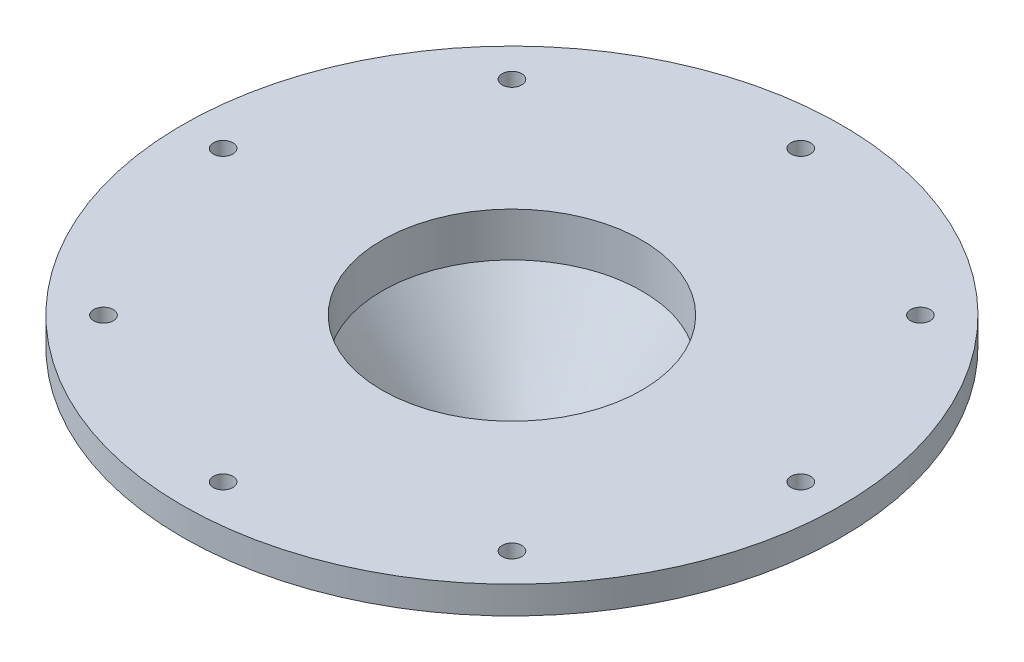
ISO-10303-21;
HEADER;
FILE_DESCRIPTION(('STEP AP214'),'2;1');
FILE_NAME('part.step','',(''),(''),'','','');
FILE_SCHEMA(('AUTOMOTIVE_DESIGN { 1 0 10303 214 1 1 1 1 }'));
ENDSEC;
DATA;
#1=APPLICATION_CONTEXT('core data for automotive mechanical design processes');
#2=APPLICATION_PROTOCOL_DEFINITION('international standard','automotive_design',2000,#1);
#3=PRODUCT_CONTEXT('',#1,'mechanical');
#4=PRODUCT('Part','Part','',(#3));
#5=PRODUCT_RELATED_PRODUCT_CATEGORY('part','',(#4));
#6=PRODUCT_DEFINITION_FORMATION('','',#4);
#7=PRODUCT_DEFINITION_CONTEXT('part definition',#1,'design');
#8=PRODUCT_DEFINITION('design','',#6,#7);
#9=PRODUCT_DEFINITION_SHAPE('','',#8);
#10=(LENGTH_UNIT() NAMED_UNIT(*) SI_UNIT(.MILLI.,.METRE.));
#11=(NAMED_UNIT(*) PLANE_ANGLE_UNIT() SI_UNIT($,.RADIAN.));
#12=(NAMED_UNIT(*) SI_UNIT($,.STERADIAN.) SOLID_ANGLE_UNIT());
#13=UNCERTAINTY_MEASURE_WITH_UNIT(LENGTH_MEASURE(1.E-05),#10,'distance_accuracy_value','');
#14=(GEOMETRIC_REPRESENTATION_CONTEXT(3) GLOBAL_UNCERTAINTY_ASSIGNED_CONTEXT((#13)) GLOBAL_UNIT_ASSIGNED_CONTEXT((#10,
#11,#12)) REPRESENTATION_CONTEXT('',''));
#15=CARTESIAN_POINT('',(0.,0.,0.));
#16=DIRECTION('',(0.,0.,1.));
#17=DIRECTION('',(1.,0.,0.));
#18=AXIS2_PLACEMENT_3D('',#15,#16,#17);
#19=CARTESIAN_POINT('',(0.,-19.05,0.));
#20=DIRECTION('',(0.,-1.,0.));
#21=DIRECTION('',(0.,0.,-1.));
#22=AXIS2_PLACEMENT_3D('',#19,#20,#21);
#23=PLANE('',#22);
#24=CARTESIAN_POINT('',(0.,-19.05,0.));
#25=DIRECTION('',(0.,-1.,0.));
#26=DIRECTION('',(0.,0.,-1.));
#27=AXIS2_PLACEMENT_3D('',#24,#25,#26);
#28=CIRCLE('',#27,5.);
#29=CARTESIAN_POINT('',(0.,-19.05,-5.));
#30=VERTEX_POINT('',#29);
#31=EDGE_CURVE('E54',#30,#30,#28,.T.);
#32=ORIENTED_EDGE('',*,*,#31,.F.);
#33=EDGE_LOOP('',(#32));
#34=FACE_BOUND('',#33,.T.);
#35=CARTESIAN_POINT('',(0.,-19.05,0.));
#36=DIRECTION('',(0.,1.,0.));
#37=DIRECTION('',(-1.,0.,0.));
#38=AXIS2_PLACEMENT_3D('',#35,#36,#37);
#39=CIRCLE('',#38,8.41515202607263);
#40=CARTESIAN_POINT('',(-8.41515202607263,-19.05,0.));
#41=VERTEX_POINT('',#40);
#42=EDGE_CURVE('E166',#41,#41,#39,.T.);
#43=ORIENTED_EDGE('',*,*,#42,.F.);
#44=EDGE_LOOP('',(#43));
#45=FACE_BOUND('',#44,.T.);
#46=ADVANCED_FACE('F35',(#34,#45),#23,.T.);
#47=CARTESIAN_POINT('',(0.,3.175,0.));
#48=DIRECTION('',(0.,-1.,0.));
#49=DIRECTION('',(0.,0.,-1.));
#50=AXIS2_PLACEMENT_3D('',#47,#48,#49);
#51=CYLINDRICAL_SURFACE('',#50,5.);
#52=CARTESIAN_POINT('',(0.,-15.875,0.));
#53=DIRECTION('',(0.,-1.,0.));
#54=DIRECTION('',(0.,0.,-1.));
#55=AXIS2_PLACEMENT_3D('',#52,#53,#54);
#56=CIRCLE('',#55,5.);
#57=CARTESIAN_POINT('',(-1.36585362623204,-15.875,4.80982784221107));
#58=VERTEX_POINT('',#57);
#59=EDGE_CURVE('E63',#58,#58,#56,.T.);
#60=ORIENTED_EDGE('',*,*,#59,.F.);
#61=EDGE_LOOP('',(#60));
#62=FACE_BOUND('',#61,.T.);
#63=ORIENTED_EDGE('',*,*,#31,.T.);
#64=EDGE_LOOP('',(#63));
#65=FACE_BOUND('',#64,.T.);
#66=ADVANCED_FACE('F69',(#62,#65),#51,.F.);
#67=CARTESIAN_POINT('',(0.,0.,0.));
#68=DIRECTION('',(0.,1.,0.));
#69=DIRECTION('',(0.,0.,1.));
#70=AXIS2_PLACEMENT_3D('',#67,#68,#69);
#71=PLANE('',#70);
#72=CARTESIAN_POINT('',(-23.5731723178062,0.,23.5731723178068));
#73=DIRECTION('',(0.,-1.,0.));
#74=DIRECTION('',(0.,0.,-1.));
#75=AXIS2_PLACEMENT_3D('',#72,#73,#74);
#76=CIRCLE('',#75,1.13029999999999);
#77=CARTESIAN_POINT('',(-23.5731723178062,0.,22.4428723178068));
#78=VERTEX_POINT('',#77);
#79=EDGE_CURVE('E57',#78,#78,#76,.T.);
#80=ORIENTED_EDGE('',*,*,#79,.F.);
#81=EDGE_LOOP('',(#80));
#82=FACE_BOUND('',#81,.T.);
#83=CARTESIAN_POINT('',(-33.3375,0.,3.49191777401049E-13));
#84=DIRECTION('',(0.,-1.,0.));
#85=DIRECTION('',(0.,0.,-1.));
#86=AXIS2_PLACEMENT_3D('',#83,#84,#85);
#87=CIRCLE('',#86,1.13029999999999);
#88=CARTESIAN_POINT('',(-33.3375,0.,-1.13029999999964));
#89=VERTEX_POINT('',#88);
#90=EDGE_CURVE('E135',#89,#89,#87,.T.);
#91=ORIENTED_EDGE('',*,*,#90,.F.);
#92=EDGE_LOOP('',(#91));
#93=FACE_BOUND('',#92,.T.);
#94=CARTESIAN_POINT('',(0.,0.,-33.3375));
#95=DIRECTION('',(0.,-1.,0.));
#96=DIRECTION('',(0.,0.,-1.));
#97=AXIS2_PLACEMENT_3D('',#94,#95,#96);
#98=CIRCLE('',#97,1.13029999999999);
#99=CARTESIAN_POINT('',(0.,0.,-34.4678));
#100=VERTEX_POINT('',#99);
#101=EDGE_CURVE('E139',#100,#100,#98,.T.);
#102=ORIENTED_EDGE('',*,*,#101,.F.);
#103=EDGE_LOOP('',(#102));
#104=FACE_BOUND('',#103,.T.);
#105=CARTESIAN_POINT('',(23.5731723178064,0.,-23.5731723178067));
#106=DIRECTION('',(0.,-1.,0.));
#107=DIRECTION('',(0.,0.,-1.));
#108=AXIS2_PLACEMENT_3D('',#105,#106,#107);
#109=CIRCLE('',#108,1.13029999999999);
#110=CARTESIAN_POINT('',(23.5731723178064,0.,-24.7034723178066));
#111=VERTEX_POINT('',#110);
#112=EDGE_CURVE('E143',#111,#111,#109,.T.);
#113=ORIENTED_EDGE('',*,*,#112,.F.);
#114=EDGE_LOOP('',(#113));
#115=FACE_BOUND('',#114,.T.);
#116=CARTESIAN_POINT('',(33.3375,0.,-1.16397259133683E-13));
#117=DIRECTION('',(0.,-1.,0.));
#118=DIRECTION('',(0.,0.,-1.));
#119=AXIS2_PLACEMENT_3D('',#116,#117,#118);
#120=CIRCLE('',#119,1.13029999999999);
#121=CARTESIAN_POINT('',(33.3375,0.,-1.1303000000001));
#122=VERTEX_POINT('',#121);
#123=EDGE_CURVE('E147',#122,#122,#120,.T.);
#124=ORIENTED_EDGE('',*,*,#123,.F.);
#125=EDGE_LOOP('',(#124));
#126=FACE_BOUND('',#125,.T.);
#127=CARTESIAN_POINT('',(23.5731723178066,0.,23.5731723178065));
#128=DIRECTION('',(0.,-1.,0.));
#129=DIRECTION('',(0.,0.,-1.));
#130=AXIS2_PLACEMENT_3D('',#127,#128,#129);
#131=CIRCLE('',#130,1.13029999999999);
#132=CARTESIAN_POINT('',(23.5731723178066,0.,22.4428723178065));
#133=VERTEX_POINT('',#132);
#134=EDGE_CURVE('E151',#133,#133,#131,.T.);
#135=ORIENTED_EDGE('',*,*,#134,.F.);
#136=EDGE_LOOP('',(#135));
#137=FACE_BOUND('',#136,.T.);
#138=CARTESIAN_POINT('',(0.,0.,33.3375));
#139=DIRECTION('',(0.,-1.,0.));
#140=DIRECTION('',(0.,0.,-1.));
#141=AXIS2_PLACEMENT_3D('',#138,#139,#140);
#142=CIRCLE('',#141,1.13029999999999);
#143=CARTESIAN_POINT('',(0.,0.,32.2072));
#144=VERTEX_POINT('',#143);
#145=EDGE_CURVE('E155',#144,#144,#142,.T.);
#146=ORIENTED_EDGE('',*,*,#145,.F.);
#147=EDGE_LOOP('',(#146));
#148=FACE_BOUND('',#147,.T.);
#149=CARTESIAN_POINT('',(0.,0.,0.));
#150=DIRECTION('',(0.,1.,0.));
#151=DIRECTION('',(0.,0.,1.));
#152=AXIS2_PLACEMENT_3D('',#149,#150,#151);
#153=CIRCLE('',#152,38.04031);
#154=CARTESIAN_POINT('',(0.,0.,38.04031));
#155=VERTEX_POINT('',#154);
#156=EDGE_CURVE('E44',#155,#155,#153,.T.);
#157=ORIENTED_EDGE('',*,*,#156,.F.);
#158=EDGE_LOOP('',(#157));
#159=FACE_BOUND('',#158,.T.);
#160=CARTESIAN_POINT('',(-23.5731723178067,0.,-23.5731723178063));
#161=DIRECTION('',(0.,-1.,0.));
#162=DIRECTION('',(0.,0.,-1.));
#163=AXIS2_PLACEMENT_3D('',#160,#161,#162);
#164=CIRCLE('',#163,1.13029999999999);
#165=CARTESIAN_POINT('',(-23.5731723178067,0.,-24.7034723178063));
#166=VERTEX_POINT('',#165);
#167=EDGE_CURVE('E161',#166,#166,#164,.T.);
#168=ORIENTED_EDGE('',*,*,#167,.F.);
#169=EDGE_LOOP('',(#168));
#170=FACE_BOUND('',#169,.T.);
#171=CARTESIAN_POINT('',(0.,0.,0.));
#172=DIRECTION('',(0.,1.,0.));
#173=DIRECTION('',(-1.,0.,0.));
#174=AXIS2_PLACEMENT_3D('',#171,#172,#173);
#175=CIRCLE('',#174,24.4);
#176=CARTESIAN_POINT('',(-24.4,0.,0.));
#177=VERTEX_POINT('',#176);
#178=EDGE_CURVE('E164',#177,#177,#175,.T.);
#179=ORIENTED_EDGE('',*,*,#178,.T.);
#180=EDGE_LOOP('',(#179));
#181=FACE_BOUND('',#180,.T.);
#182=ADVANCED_FACE('F79',(#82,#93,#104,#115,#126,#137,#148,#159,#170,#181),#71,.F.);
#183=CARTESIAN_POINT('',(0.,3.175,0.));
#184=DIRECTION('',(0.,-1.,0.));
#185=DIRECTION('',(0.,0.,-1.));
#186=AXIS2_PLACEMENT_3D('',#183,#184,#185);
#187=CYLINDRICAL_SURFACE('',#186,38.04031);
#188=CARTESIAN_POINT('',(0.,3.175,0.));
#189=DIRECTION('',(0.,1.,0.));
#190=DIRECTION('',(0.,0.,1.));
#191=AXIS2_PLACEMENT_3D('',#188,#189,#190);
#192=CIRCLE('',#191,38.04031);
#193=CARTESIAN_POINT('',(0.,3.175,38.04031));
#194=VERTEX_POINT('',#193);
#195=EDGE_CURVE('E11',#194,#194,#192,.T.);
#196=ORIENTED_EDGE('',*,*,#195,.F.);
#197=EDGE_LOOP('',(#196));
#198=FACE_BOUND('',#197,.T.);
#199=ORIENTED_EDGE('',*,*,#156,.T.);
#200=EDGE_LOOP('',(#199));
#201=FACE_BOUND('',#200,.T.);
#202=ADVANCED_FACE('F37',(#198,#201),#187,.T.);
#203=CARTESIAN_POINT('',(0.,3.175,0.));
#204=DIRECTION('',(0.,1.,0.));
#205=DIRECTION('',(0.,0.,1.));
#206=AXIS2_PLACEMENT_3D('',#203,#204,#205);
#207=PLANE('',#206);
#208=CARTESIAN_POINT('',(0.,3.175,0.));
#209=DIRECTION('',(0.,1.,0.));
#210=DIRECTION('',(0.,0.,1.));
#211=AXIS2_PLACEMENT_3D('',#208,#209,#210);
#212=CIRCLE('',#211,15.);
#213=CARTESIAN_POINT('',(0.,3.175,15.));
#214=VERTEX_POINT('',#213);
#215=EDGE_CURVE('E58',#214,#214,#212,.T.);
#216=ORIENTED_EDGE('',*,*,#215,.F.);
#217=EDGE_LOOP('',(#216));
#218=FACE_BOUND('',#217,.T.);
#219=CARTESIAN_POINT('',(-23.5731723178062,3.175,23.5731723178068));
#220=DIRECTION('',(0.,-1.,0.));
#221=DIRECTION('',(0.,0.,-1.));
#222=AXIS2_PLACEMENT_3D('',#219,#220,#221);
#223=CIRCLE('',#222,1.1303);
#224=CARTESIAN_POINT('',(-23.5731723178062,3.175,22.4428723178068));
#225=VERTEX_POINT('',#224);
#226=EDGE_CURVE('E211',#225,#225,#223,.T.);
#227=ORIENTED_EDGE('',*,*,#226,.T.);
#228=EDGE_LOOP('',(#227));
#229=FACE_BOUND('',#228,.T.);
#230=CARTESIAN_POINT('',(-33.3375,3.175,3.49191777401049E-13));
#231=DIRECTION('',(0.,-1.,0.));
#232=DIRECTION('',(0.,0.,-1.));
#233=AXIS2_PLACEMENT_3D('',#230,#231,#232);
#234=CIRCLE('',#233,1.1303);
#235=CARTESIAN_POINT('',(-33.3375,3.175,-1.13029999999965));
#236=VERTEX_POINT('',#235);
#237=EDGE_CURVE('E215',#236,#236,#234,.T.);
#238=ORIENTED_EDGE('',*,*,#237,.T.);
#239=EDGE_LOOP('',(#238));
#240=FACE_BOUND('',#239,.T.);
#241=CARTESIAN_POINT('',(-23.5731723178067,3.175,-23.5731723178063));
#242=DIRECTION('',(0.,-1.,0.));
#243=DIRECTION('',(0.,0.,-1.));
#244=AXIS2_PLACEMENT_3D('',#241,#242,#243);
#245=CIRCLE('',#244,1.1303);
#246=CARTESIAN_POINT('',(-23.5731723178067,3.175,-24.7034723178063));
#247=VERTEX_POINT('',#246);
#248=EDGE_CURVE('E219',#247,#247,#245,.T.);
#249=ORIENTED_EDGE('',*,*,#248,.T.);
#250=EDGE_LOOP('',(#249));
#251=FACE_BOUND('',#250,.T.);
#252=CARTESIAN_POINT('',(0.,3.175,-33.3375));
#253=DIRECTION('',(0.,-1.,0.));
#254=DIRECTION('',(0.,0.,-1.));
#255=AXIS2_PLACEMENT_3D('',#252,#253,#254);
#256=CIRCLE('',#255,1.1303);
#257=CARTESIAN_POINT('',(0.,3.175,-34.4678));
#258=VERTEX_POINT('',#257);
#259=EDGE_CURVE('E223',#258,#258,#256,.T.);
#260=ORIENTED_EDGE('',*,*,#259,.T.);
#261=EDGE_LOOP('',(#260));
#262=FACE_BOUND('',#261,.T.);
#263=CARTESIAN_POINT('',(23.5731723178064,3.175,-23.5731723178067));
#264=DIRECTION('',(0.,-1.,0.));
#265=DIRECTION('',(0.,0.,-1.));
#266=AXIS2_PLACEMENT_3D('',#263,#264,#265);
#267=CIRCLE('',#266,1.1303);
#268=CARTESIAN_POINT('',(23.5731723178064,3.175,-24.7034723178067));
#269=VERTEX_POINT('',#268);
#270=EDGE_CURVE('E227',#269,#269,#267,.T.);
#271=ORIENTED_EDGE('',*,*,#270,.T.);
#272=EDGE_LOOP('',(#271));
#273=FACE_BOUND('',#272,.T.);
#274=CARTESIAN_POINT('',(33.3375,3.175,-1.16397259133683E-13));
#275=DIRECTION('',(0.,-1.,0.));
#276=DIRECTION('',(0.,0.,-1.));
#277=AXIS2_PLACEMENT_3D('',#274,#275,#276);
#278=CIRCLE('',#277,1.1303);
#279=CARTESIAN_POINT('',(33.3375,3.175,-1.13030000000012));
#280=VERTEX_POINT('',#279);
#281=EDGE_CURVE('E231',#280,#280,#278,.T.);
#282=ORIENTED_EDGE('',*,*,#281,.T.);
#283=EDGE_LOOP('',(#282));
#284=FACE_BOUND('',#283,.T.);
#285=CARTESIAN_POINT('',(23.5731723178066,3.175,23.5731723178065));
#286=DIRECTION('',(0.,-1.,0.));
#287=DIRECTION('',(0.,0.,-1.));
#288=AXIS2_PLACEMENT_3D('',#285,#286,#287);
#289=CIRCLE('',#288,1.1303);
#290=CARTESIAN_POINT('',(23.5731723178066,3.175,22.4428723178065));
#291=VERTEX_POINT('',#290);
#292=EDGE_CURVE('E235',#291,#291,#289,.T.);
#293=ORIENTED_EDGE('',*,*,#292,.T.);
#294=EDGE_LOOP('',(#293));
#295=FACE_BOUND('',#294,.T.);
#296=CARTESIAN_POINT('',(0.,3.175,33.3375));
#297=DIRECTION('',(0.,-1.,0.));
#298=DIRECTION('',(0.,0.,-1.));
#299=AXIS2_PLACEMENT_3D('',#296,#297,#298);
#300=CIRCLE('',#299,1.1303);
#301=CARTESIAN_POINT('',(0.,3.175,32.2072));
#302=VERTEX_POINT('',#301);
#303=EDGE_CURVE('E49',#302,#302,#300,.T.);
#304=ORIENTED_EDGE('',*,*,#303,.T.);
#305=EDGE_LOOP('',(#304));
#306=FACE_BOUND('',#305,.T.);
#307=ORIENTED_EDGE('',*,*,#195,.T.);
#308=EDGE_LOOP('',(#307));
#309=FACE_BOUND('',#308,.T.);
#310=ADVANCED_FACE('F117',(#218,#229,#240,#251,#262,#273,#284,#295,#306,#309),#207,.T.);
#311=CARTESIAN_POINT('',(0.,0.,33.3375));
#312=DIRECTION('',(0.,-1.,0.));
#313=DIRECTION('',(0.,0.,-1.));
#314=AXIS2_PLACEMENT_3D('',#311,#312,#313);
#315=CYLINDRICAL_SURFACE('',#314,1.13029999999999);
#316=ORIENTED_EDGE('',*,*,#303,.F.);
#317=EDGE_LOOP('',(#316));
#318=FACE_BOUND('',#317,.T.);
#319=ORIENTED_EDGE('',*,*,#145,.T.);
#320=EDGE_LOOP('',(#319));
#321=FACE_BOUND('',#320,.T.);
#322=ADVANCED_FACE('F113',(#318,#321),#315,.F.);
#323=CARTESIAN_POINT('',(23.5731723178066,0.,23.5731723178065));
#324=DIRECTION('',(0.,-1.,0.));
#325=DIRECTION('',(0.,0.,-1.));
#326=AXIS2_PLACEMENT_3D('',#323,#324,#325);
#327=CYLINDRICAL_SURFACE('',#326,1.13029999999999);
#328=ORIENTED_EDGE('',*,*,#292,.F.);
#329=EDGE_LOOP('',(#328));
#330=FACE_BOUND('',#329,.T.);
#331=ORIENTED_EDGE('',*,*,#134,.T.);
#332=EDGE_LOOP('',(#331));
#333=FACE_BOUND('',#332,.T.);
#334=ADVANCED_FACE('F109',(#330,#333),#327,.F.);
#335=CARTESIAN_POINT('',(33.3375,0.,-1.16397259133683E-13));
#336=DIRECTION('',(0.,-1.,0.));
#337=DIRECTION('',(0.,0.,-1.));
#338=AXIS2_PLACEMENT_3D('',#335,#336,#337);
#339=CYLINDRICAL_SURFACE('',#338,1.13029999999999);
#340=ORIENTED_EDGE('',*,*,#281,.F.);
#341=EDGE_LOOP('',(#340));
#342=FACE_BOUND('',#341,.T.);
#343=ORIENTED_EDGE('',*,*,#123,.T.);
#344=EDGE_LOOP('',(#343));
#345=FACE_BOUND('',#344,.T.);
#346=ADVANCED_FACE('F105',(#342,#345),#339,.F.);
#347=CARTESIAN_POINT('',(23.5731723178064,0.,-23.5731723178067));
#348=DIRECTION('',(0.,-1.,0.));
#349=DIRECTION('',(0.,0.,-1.));
#350=AXIS2_PLACEMENT_3D('',#347,#348,#349);
#351=CYLINDRICAL_SURFACE('',#350,1.13029999999999);
#352=ORIENTED_EDGE('',*,*,#270,.F.);
#353=EDGE_LOOP('',(#352));
#354=FACE_BOUND('',#353,.T.);
#355=ORIENTED_EDGE('',*,*,#112,.T.);
#356=EDGE_LOOP('',(#355));
#357=FACE_BOUND('',#356,.T.);
#358=ADVANCED_FACE('F101',(#354,#357),#351,.F.);
#359=CARTESIAN_POINT('',(0.,0.,-33.3375));
#360=DIRECTION('',(0.,-1.,0.));
#361=DIRECTION('',(0.,0.,-1.));
#362=AXIS2_PLACEMENT_3D('',#359,#360,#361);
#363=CYLINDRICAL_SURFACE('',#362,1.13029999999999);
#364=ORIENTED_EDGE('',*,*,#259,.F.);
#365=EDGE_LOOP('',(#364));
#366=FACE_BOUND('',#365,.T.);
#367=ORIENTED_EDGE('',*,*,#101,.T.);
#368=EDGE_LOOP('',(#367));
#369=FACE_BOUND('',#368,.T.);
#370=ADVANCED_FACE('F97',(#366,#369),#363,.F.);
#371=CARTESIAN_POINT('',(-23.5731723178067,0.,-23.5731723178063));
#372=DIRECTION('',(0.,-1.,0.));
#373=DIRECTION('',(0.,0.,-1.));
#374=AXIS2_PLACEMENT_3D('',#371,#372,#373);
#375=CYLINDRICAL_SURFACE('',#374,1.13029999999999);
#376=ORIENTED_EDGE('',*,*,#248,.F.);
#377=EDGE_LOOP('',(#376));
#378=FACE_BOUND('',#377,.T.);
#379=ORIENTED_EDGE('',*,*,#167,.T.);
#380=EDGE_LOOP('',(#379));
#381=FACE_BOUND('',#380,.T.);
#382=ADVANCED_FACE('F93',(#378,#381),#375,.F.);
#383=CARTESIAN_POINT('',(-33.3375,0.,3.49191777401049E-13));
#384=DIRECTION('',(0.,-1.,0.));
#385=DIRECTION('',(0.,0.,-1.));
#386=AXIS2_PLACEMENT_3D('',#383,#384,#385);
#387=CYLINDRICAL_SURFACE('',#386,1.13029999999999);
#388=ORIENTED_EDGE('',*,*,#237,.F.);
#389=EDGE_LOOP('',(#388));
#390=FACE_BOUND('',#389,.T.);
#391=ORIENTED_EDGE('',*,*,#90,.T.);
#392=EDGE_LOOP('',(#391));
#393=FACE_BOUND('',#392,.T.);
#394=ADVANCED_FACE('F89',(#390,#393),#387,.F.);
#395=CARTESIAN_POINT('',(-23.5731723178062,0.,23.5731723178068));
#396=DIRECTION('',(0.,-1.,0.));
#397=DIRECTION('',(0.,0.,-1.));
#398=AXIS2_PLACEMENT_3D('',#395,#396,#397);
#399=CYLINDRICAL_SURFACE('',#398,1.13029999999999);
#400=ORIENTED_EDGE('',*,*,#226,.F.);
#401=EDGE_LOOP('',(#400));
#402=FACE_BOUND('',#401,.T.);
#403=ORIENTED_EDGE('',*,*,#79,.T.);
#404=EDGE_LOOP('',(#403));
#405=FACE_BOUND('',#404,.T.);
#406=ADVANCED_FACE('F86',(#402,#405),#399,.F.);
#407=CARTESIAN_POINT('',(0.,-1.905,0.));
#408=DIRECTION('',(0.,1.,0.));
#409=DIRECTION('',(0.,0.,1.));
#410=AXIS2_PLACEMENT_3D('',#407,#408,#409);
#411=CYLINDRICAL_SURFACE('',#410,15.);
#412=CARTESIAN_POINT('',(0.,-1.905,0.));
#413=DIRECTION('',(0.,1.,0.));
#414=DIRECTION('',(0.,0.,1.));
#415=AXIS2_PLACEMENT_3D('',#412,#413,#414);
#416=CIRCLE('',#415,15.);
#417=CARTESIAN_POINT('',(0.,-1.905,15.));
#418=VERTEX_POINT('',#417);
#419=EDGE_CURVE('E39',#418,#418,#416,.T.);
#420=ORIENTED_EDGE('',*,*,#419,.F.);
#421=EDGE_LOOP('',(#420));
#422=FACE_BOUND('',#421,.T.);
#423=ORIENTED_EDGE('',*,*,#215,.T.);
#424=EDGE_LOOP('',(#423));
#425=FACE_BOUND('',#424,.T.);
#426=ADVANCED_FACE('F80',(#422,#425),#411,.F.);
#427=CARTESIAN_POINT('',(0.,-1.905,15.));
#428=CARTESIAN_POINT('',(-1.36585362623204,-15.875,4.80982784221107));
#429=CARTESIAN_POINT('',(-30.,-1.905,15.));
#430=CARTESIAN_POINT('',(-10.9855093106542,-15.875,2.07812058974699));
#431=CARTESIAN_POINT('',(-30.,-1.905,-15.));
#432=CARTESIAN_POINT('',(-8.2538020581901,-15.875,-7.54153509467515));
#433=CARTESIAN_POINT('',(0.,-1.905,-15.));
#434=CARTESIAN_POINT('',(1.36585362623204,-15.875,-4.80982784221107));
#435=CARTESIAN_POINT('',(30.,-1.905,-15.));
#436=CARTESIAN_POINT('',(10.9855093106542,-15.875,-2.07812058974699));
#437=CARTESIAN_POINT('',(30.,-1.905,15.));
#438=CARTESIAN_POINT('',(8.2538020581901,-15.875,7.54153509467515));
#439=CARTESIAN_POINT('',(0.,-1.905,15.));
#440=CARTESIAN_POINT('',(-1.36585362623204,-15.875,4.80982784221107));
#441=(BOUNDED_SURFACE() B_SPLINE_SURFACE(3,1,((#427,#428),(#429,#430),(#431,#432),(#433,#434),
(#435,#436),(#437,#438),(#439,#440)),.UNSPECIFIED.,.T.,.F.,.F.) B_SPLINE_SURFACE_WITH_KNOTS((4,
3,4),(2,2),(0.,0.5,1.),(0.,1.),
.UNSPECIFIED.) GEOMETRIC_REPRESENTATION_ITEM() RATIONAL_B_SPLINE_SURFACE(((1.,1.),
(0.333333333333333,0.333333333333333),(0.333333333333333,0.333333333333333),(1.,1.),
(0.333333333333333,0.333333333333333),(0.333333333333333,0.333333333333333),(1.,1.))) REPRESENTATION_ITEM('') SURFACE());
#442=CARTESIAN_POINT('',(0.,-1.905,15.));
#443=CARTESIAN_POINT('',(-0.0142276419399171,-2.05052083333333,14.8938523733564));
#444=CARTESIAN_POINT('',(-0.0284552838798341,-2.19604166666667,14.7877047467127));
#445=CARTESIAN_POINT('',(-0.0569105677596682,-2.48708333333333,14.5754094934255));
#446=CARTESIAN_POINT('',(-0.0711382096995853,-2.63260416666667,14.4692618667818));
#447=CARTESIAN_POINT('',(-0.0995934935794194,-2.92364583333333,14.2569666134946));
#448=CARTESIAN_POINT('',(-0.113821135519336,-3.06916666666667,14.1508189868509));
#449=CARTESIAN_POINT('',(-0.142276419399171,-3.36020833333333,13.9385237335637));
#450=CARTESIAN_POINT('',(-0.156504061339088,-3.50572916666667,13.83237610692));
#451=CARTESIAN_POINT('',(-0.184959345218922,-3.79677083333333,13.6200808536327));
#452=CARTESIAN_POINT('',(-0.199186987158839,-3.94229166666667,13.5139332269891));
#453=CARTESIAN_POINT('',(-0.227642271038673,-4.23333333333333,13.3016379737018));
#454=CARTESIAN_POINT('',(-0.24186991297859,-4.37885416666667,13.1954903470582));
#455=CARTESIAN_POINT('',(-0.270325196858424,-4.66989583333333,12.9831950937709));
#456=CARTESIAN_POINT('',(-0.284552838798341,-4.81541666666667,12.8770474671273));
#457=CARTESIAN_POINT('',(-0.313008122678175,-5.10645833333333,12.66475221384));
#458=CARTESIAN_POINT('',(-0.327235764618092,-5.25197916666667,12.5586045871964));
#459=CARTESIAN_POINT('',(-0.355691048497926,-5.54302083333333,12.3463093339091));
#460=CARTESIAN_POINT('',(-0.369918690437843,-5.68854166666667,12.2401617072655));
#461=CARTESIAN_POINT('',(-0.398373974317678,-5.97958333333333,12.0278664539782));
#462=CARTESIAN_POINT('',(-0.412601616257595,-6.12510416666667,11.9217188273346));
#463=CARTESIAN_POINT('',(-0.441056900137429,-6.41614583333333,11.7094235740473));
#464=CARTESIAN_POINT('',(-0.455284542077346,-6.56166666666667,11.6032759474037));
#465=CARTESIAN_POINT('',(-0.48373982595718,-6.85270833333333,11.3909806941164));
#466=CARTESIAN_POINT('',(-0.497967467897097,-6.99822916666667,11.2848330674728));
#467=CARTESIAN_POINT('',(-0.526422751776931,-7.28927083333333,11.0725378141855));
#468=CARTESIAN_POINT('',(-0.540650393716848,-7.43479166666667,10.9663901875419));
#469=CARTESIAN_POINT('',(-0.569105677596682,-7.72583333333333,10.7540949342546));
#470=CARTESIAN_POINT('',(-0.583333319536599,-7.87135416666667,10.647947307611));
#471=CARTESIAN_POINT('',(-0.611788603416433,-8.16239583333333,10.4356520543237));
#472=CARTESIAN_POINT('',(-0.626016245356351,-8.30791666666667,10.3295044276801));
#473=CARTESIAN_POINT('',(-0.654471529236185,-8.59895833333333,10.1172091743928));
#474=CARTESIAN_POINT('',(-0.668699171176102,-8.74447916666667,10.0110615477492));
#475=CARTESIAN_POINT('',(-0.697154455055936,-9.03552083333333,9.7987662944619));
#476=CARTESIAN_POINT('',(-0.711382096995853,-9.18104166666667,9.69261866781827));
#477=CARTESIAN_POINT('',(-0.739837380875687,-9.47208333333333,9.48032341453099));
#478=CARTESIAN_POINT('',(-0.754065022815604,-9.61760416666667,9.37417578788736));
#479=CARTESIAN_POINT('',(-0.782520306695438,-9.90864583333333,9.16188053460009));
#480=CARTESIAN_POINT('',(-0.796747948635355,-10.0541666666667,9.05573290795646));
#481=CARTESIAN_POINT('',(-0.825203232515189,-10.3452083333333,8.84343765466919));
#482=CARTESIAN_POINT('',(-0.839430874455106,-10.4907291666667,8.73729002802555));
#483=CARTESIAN_POINT('',(-0.867886158334941,-10.7817708333333,8.52499477473828));
#484=CARTESIAN_POINT('',(-0.882113800274858,-10.9272916666667,8.41884714809465));
#485=CARTESIAN_POINT('',(-0.910569084154692,-11.2183333333333,8.20655189480738));
#486=CARTESIAN_POINT('',(-0.924796726094609,-11.3638541666667,8.10040426816374));
#487=CARTESIAN_POINT('',(-0.953252009974443,-11.6548958333333,7.88810901487648));
#488=CARTESIAN_POINT('',(-0.96747965191436,-11.8004166666667,7.78196138823284));
#489=CARTESIAN_POINT('',(-0.995934935794194,-12.0914583333333,7.56966613494557));
#490=CARTESIAN_POINT('',(-1.01016257773411,-12.2369791666667,7.46351850830194));
#491=CARTESIAN_POINT('',(-1.03861786161395,-12.5280208333333,7.25122325501467));
#492=CARTESIAN_POINT('',(-1.05284550355386,-12.6735416666667,7.14507562837103));
#493=CARTESIAN_POINT('',(-1.0813007874337,-12.9645833333333,6.93278037508376));
#494=CARTESIAN_POINT('',(-1.09552842937361,-13.1101041666667,6.82663274844013));
#495=CARTESIAN_POINT('',(-1.12398371325345,-13.4011458333333,6.61433749515286));
#496=CARTESIAN_POINT('',(-1.13821135519336,-13.5466666666667,6.50818986850923));
#497=CARTESIAN_POINT('',(-1.1666666390732,-13.8377083333333,6.29589461522196));
#498=CARTESIAN_POINT('',(-1.18089428101312,-13.9832291666667,6.18974698857832));
#499=CARTESIAN_POINT('',(-1.20934956489295,-14.2742708333333,5.97745173529105));
#500=CARTESIAN_POINT('',(-1.22357720683287,-14.4197916666667,5.87130410864742));
#501=CARTESIAN_POINT('',(-1.2520324907127,-14.7108333333333,5.65900885536015));
#502=CARTESIAN_POINT('',(-1.26626013265262,-14.8563541666667,5.55286122871651));
#503=CARTESIAN_POINT('',(-1.29471541653245,-15.1473958333333,5.34056597542924));
#504=CARTESIAN_POINT('',(-1.30894305847237,-15.2929166666667,5.23441834878561));
#505=CARTESIAN_POINT('',(-1.3373983423522,-15.5839583333333,5.02212309549834));
#506=CARTESIAN_POINT('',(-1.35162598429212,-15.7294791666667,4.9159754688547));
#507=CARTESIAN_POINT('',(-1.36585362623204,-15.875,4.80982784221107));
#508=B_SPLINE_CURVE_WITH_KNOTS('',3,(#442,#443,#444,#445,#446,#447,#448,#449,#450,#451,#452,
#453,#454,#455,#456,#457,#458,#459,#460,#461,#462,#463,#464,#465,#466,#467,#468,#469,#470,#471,
#472,#473,#474,#475,#476,#477,#478,#479,#480,#481,#482,#483,#484,#485,#486,#487,#488,#489,#490,
#491,#492,#493,#494,#495,#496,#497,#498,#499,#500,#501,#502,#503,#504,#505,#506,#507),
.UNSPECIFIED.,.F.,.F.,(4,2,2,2,2,2,2,2,2,2,2,2,2,2,2,2,2,2,2,2,2,2,2,2,2,2,2,2,2,2,2,2,4),(0.,
0.542046599787761,1.08409319957552,1.62613979936328,2.16818639915104,2.7102329989388,
3.25227959872656,3.79432619851432,4.33637279830208,4.87841939808984,5.42046599787761,
5.96251259766536,6.50455919745313,7.04660579724089,7.58865239702865,8.13069899681641,
8.67274559660417,9.21479219639193,9.75683879617969,10.2988853959674,10.8409319957552,
11.382978595543,11.9250251953307,12.4670717951185,13.0091183949063,13.551164994694,
14.0932115944818,14.6352581942695,15.1773047940573,15.7193513938451,16.2613979936328,
16.8034445934206,17.3454911932083),.UNSPECIFIED.);
#509=EDGE_CURVE('BSEAM178',#418,#58,#508,.T.);
#510=ORIENTED_EDGE('',*,*,#419,.T.);
#511=ORIENTED_EDGE('',*,*,#59,.T.);
#512=ORIENTED_EDGE('',*,*,#509,.T.);
#513=ORIENTED_EDGE('',*,*,#509,.F.);
#514=EDGE_LOOP('',(#510,#512,#511,#513));
#515=FACE_BOUND('',#514,.T.);
#516=ADVANCED_FACE('F178',(#515),#441,.F.);
#517=CARTESIAN_POINT('',(0.,0.,0.));
#518=DIRECTION('',(0.,1.,0.));
#519=DIRECTION('',(-1.,0.,0.));
#520=AXIS2_PLACEMENT_3D('',#517,#518,#519);
#521=CONICAL_SURFACE('',#520,24.4,0.698131700797738);
#522=ORIENTED_EDGE('',*,*,#42,.T.);
#523=EDGE_LOOP('',(#522));
#524=FACE_BOUND('',#523,.T.);
#525=ORIENTED_EDGE('',*,*,#178,.F.);
#526=EDGE_LOOP('',(#525));
#527=FACE_BOUND('',#526,.T.);
#528=ADVANCED_FACE('F189',(#524,#527),#521,.T.);
#529=CLOSED_SHELL('',(#46,#66,#182,#202,#310,#322,#334,#346,#358,#370,#382,#394,#406,#426,#516,#528));
#530=MANIFOLD_SOLID_BREP('B2',#529);
#531=ADVANCED_BREP_SHAPE_REPRESENTATION('',(#18,#530),#14);
#532=SHAPE_DEFINITION_REPRESENTATION(#9,#531);
ENDSEC;
END-ISO-10303-21;
